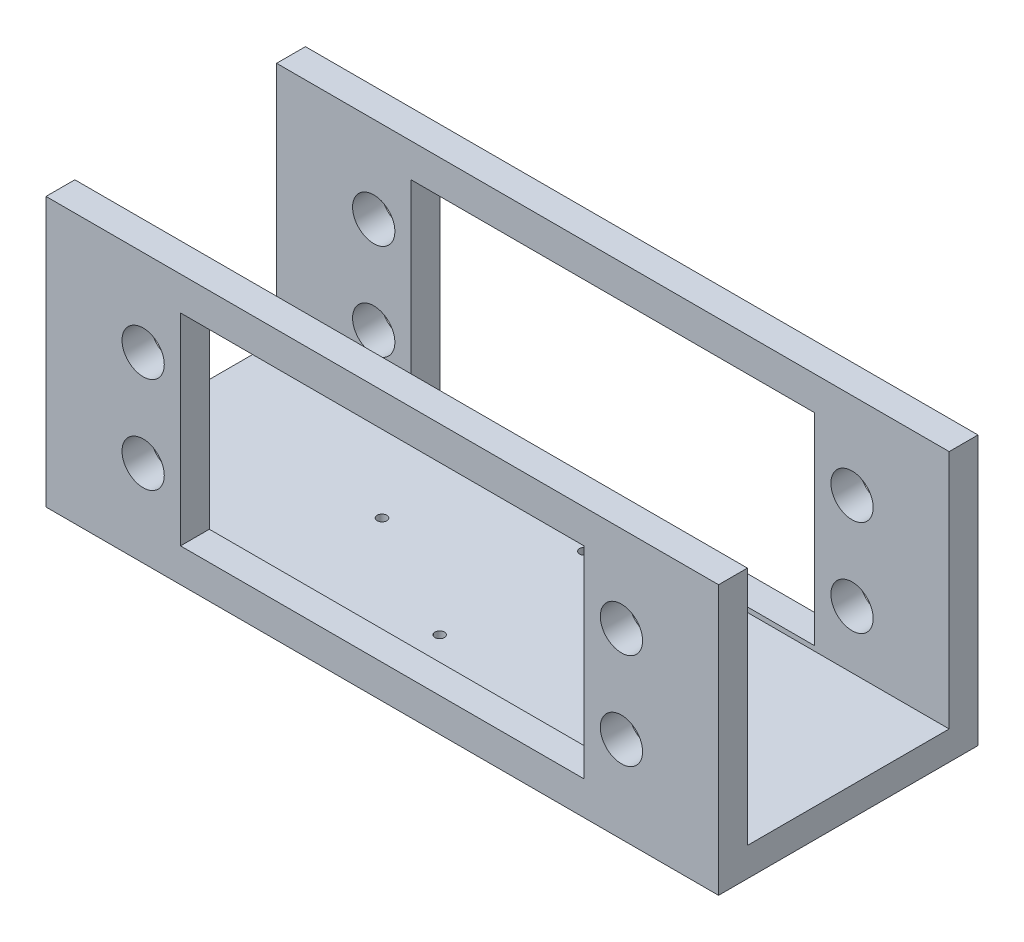
ISO-10303-21;
HEADER;
FILE_DESCRIPTION(('STEP AP214'),'2;1');
FILE_NAME('part.step','',(''),(''),'','','');
FILE_SCHEMA(('AUTOMOTIVE_DESIGN { 1 0 10303 214 1 1 1 1 }'));
ENDSEC;
DATA;
#1=APPLICATION_CONTEXT('core data for automotive mechanical design processes');
#2=APPLICATION_PROTOCOL_DEFINITION('international standard','automotive_design',2000,#1);
#3=PRODUCT_CONTEXT('',#1,'mechanical');
#4=PRODUCT('Part','Part','',(#3));
#5=PRODUCT_RELATED_PRODUCT_CATEGORY('part','',(#4));
#6=PRODUCT_DEFINITION_FORMATION('','',#4);
#7=PRODUCT_DEFINITION_CONTEXT('part definition',#1,'design');
#8=PRODUCT_DEFINITION('design','',#6,#7);
#9=PRODUCT_DEFINITION_SHAPE('','',#8);
#10=(LENGTH_UNIT() NAMED_UNIT(*) SI_UNIT(.MILLI.,.METRE.));
#11=(NAMED_UNIT(*) PLANE_ANGLE_UNIT() SI_UNIT($,.RADIAN.));
#12=(NAMED_UNIT(*) SI_UNIT($,.STERADIAN.) SOLID_ANGLE_UNIT());
#13=UNCERTAINTY_MEASURE_WITH_UNIT(LENGTH_MEASURE(1.E-05),#10,'distance_accuracy_value','');
#14=(GEOMETRIC_REPRESENTATION_CONTEXT(3) GLOBAL_UNCERTAINTY_ASSIGNED_CONTEXT((#13)) GLOBAL_UNIT_ASSIGNED_CONTEXT((#10,
#11,#12)) REPRESENTATION_CONTEXT('',''));
#15=CARTESIAN_POINT('',(0.,0.,0.));
#16=DIRECTION('',(0.,0.,1.));
#17=DIRECTION('',(1.,0.,0.));
#18=AXIS2_PLACEMENT_3D('',#15,#16,#17);
#19=CARTESIAN_POINT('',(-35.,3.,13.5));
#20=DIRECTION('',(0.,0.,-1.));
#21=DIRECTION('',(-1.,0.,0.));
#22=AXIS2_PLACEMENT_3D('',#19,#20,#21);
#23=PLANE('',#22);
#24=DIRECTION('',(0.,-1.,0.));
#25=VECTOR('',#24,1.);
#26=CARTESIAN_POINT('',(21.,24.5,13.5));
#27=LINE('',#26,#25);
#28=CARTESIAN_POINT('',(21.,24.5,13.5));
#29=VERTEX_POINT('',#28);
#30=CARTESIAN_POINT('',(21.,3.5,13.5));
#31=VERTEX_POINT('',#30);
#32=EDGE_CURVE('E255',#29,#31,#27,.T.);
#33=ORIENTED_EDGE('',*,*,#32,.T.);
#34=DIRECTION('',(1.,0.,0.));
#35=VECTOR('',#34,1.);
#36=CARTESIAN_POINT('',(-21.,3.5,13.5));
#37=LINE('',#36,#35);
#38=CARTESIAN_POINT('',(-21.,3.5,13.5));
#39=VERTEX_POINT('',#38);
#40=EDGE_CURVE('E60',#39,#31,#37,.T.);
#41=ORIENTED_EDGE('',*,*,#40,.F.);
#42=DIRECTION('',(0.,-1.,0.));
#43=VECTOR('',#42,1.);
#44=CARTESIAN_POINT('',(-21.,24.5,13.5));
#45=LINE('',#44,#43);
#46=CARTESIAN_POINT('',(-21.,24.5,13.5));
#47=VERTEX_POINT('',#46);
#48=EDGE_CURVE('E242',#47,#39,#45,.T.);
#49=ORIENTED_EDGE('',*,*,#48,.F.);
#50=DIRECTION('',(1.,0.,0.));
#51=VECTOR('',#50,1.);
#52=CARTESIAN_POINT('',(-21.,24.5,13.5));
#53=LINE('',#52,#51);
#54=EDGE_CURVE('E252',#47,#29,#53,.T.);
#55=ORIENTED_EDGE('',*,*,#54,.T.);
#56=EDGE_LOOP('',(#33,#41,#49,#55));
#57=FACE_BOUND('',#56,.T.);
#58=CARTESIAN_POINT('',(-24.89,19.,13.5));
#59=DIRECTION('',(0.,0.,1.));
#60=DIRECTION('',(1.,0.,0.));
#61=AXIS2_PLACEMENT_3D('',#58,#59,#60);
#62=CIRCLE('',#61,2.2);
#63=CARTESIAN_POINT('',(-22.69,19.,13.5));
#64=VERTEX_POINT('',#63);
#65=EDGE_CURVE('E236',#64,#64,#62,.T.);
#66=ORIENTED_EDGE('',*,*,#65,.F.);
#67=EDGE_LOOP('',(#66));
#68=FACE_BOUND('',#67,.T.);
#69=CARTESIAN_POINT('',(-24.89,9.,13.5));
#70=DIRECTION('',(0.,0.,1.));
#71=DIRECTION('',(1.,0.,0.));
#72=AXIS2_PLACEMENT_3D('',#69,#70,#71);
#73=CIRCLE('',#72,2.2);
#74=CARTESIAN_POINT('',(-22.69,9.,13.5));
#75=VERTEX_POINT('',#74);
#76=EDGE_CURVE('E239',#75,#75,#73,.F.);
#77=ORIENTED_EDGE('',*,*,#76,.T.);
#78=EDGE_LOOP('',(#77));
#79=FACE_BOUND('',#78,.T.);
#80=DIRECTION('',(0.,-1.,0.));
#81=VECTOR('',#80,1.);
#82=CARTESIAN_POINT('',(-35.,3.,13.5));
#83=LINE('',#82,#81);
#84=CARTESIAN_POINT('',(-35.,28.,13.5));
#85=VERTEX_POINT('',#84);
#86=CARTESIAN_POINT('',(-35.,0.,13.5));
#87=VERTEX_POINT('',#86);
#88=EDGE_CURVE('E324',#85,#87,#83,.T.);
#89=ORIENTED_EDGE('',*,*,#88,.T.);
#90=DIRECTION('',(1.,0.,0.));
#91=VECTOR('',#90,1.);
#92=CARTESIAN_POINT('',(-35.,0.,13.5));
#93=LINE('',#92,#91);
#94=CARTESIAN_POINT('',(35.,0.,13.5));
#95=VERTEX_POINT('',#94);
#96=EDGE_CURVE('E311',#87,#95,#93,.T.);
#97=ORIENTED_EDGE('',*,*,#96,.T.);
#98=DIRECTION('',(0.,-1.,0.));
#99=VECTOR('',#98,1.);
#100=CARTESIAN_POINT('',(35.,3.,13.5));
#101=LINE('',#100,#99);
#102=CARTESIAN_POINT('',(35.,28.,13.5));
#103=VERTEX_POINT('',#102);
#104=EDGE_CURVE('E313',#103,#95,#101,.T.);
#105=ORIENTED_EDGE('',*,*,#104,.F.);
#106=DIRECTION('',(1.,0.,0.));
#107=VECTOR('',#106,1.);
#108=CARTESIAN_POINT('',(0.,28.,13.5));
#109=LINE('',#108,#107);
#110=EDGE_CURVE('E273',#85,#103,#109,.T.);
#111=ORIENTED_EDGE('',*,*,#110,.F.);
#112=EDGE_LOOP('',(#89,#97,#105,#111));
#113=FACE_BOUND('',#112,.T.);
#114=CARTESIAN_POINT('',(24.89,19.,13.5));
#115=DIRECTION('',(0.,0.,-1.));
#116=DIRECTION('',(-1.,0.,0.));
#117=AXIS2_PLACEMENT_3D('',#114,#115,#116);
#118=CIRCLE('',#117,2.2);
#119=CARTESIAN_POINT('',(22.69,19.,13.5));
#120=VERTEX_POINT('',#119);
#121=EDGE_CURVE('E249',#120,#120,#118,.T.);
#122=ORIENTED_EDGE('',*,*,#121,.T.);
#123=EDGE_LOOP('',(#122));
#124=FACE_BOUND('',#123,.T.);
#125=CARTESIAN_POINT('',(24.89,9.00000000000001,13.5));
#126=DIRECTION('',(0.,0.,1.));
#127=DIRECTION('',(1.,0.,0.));
#128=AXIS2_PLACEMENT_3D('',#125,#126,#127);
#129=CIRCLE('',#128,2.2);
#130=CARTESIAN_POINT('',(27.09,9.00000000000001,13.5));
#131=VERTEX_POINT('',#130);
#132=EDGE_CURVE('E231',#131,#131,#129,.T.);
#133=ORIENTED_EDGE('',*,*,#132,.F.);
#134=EDGE_LOOP('',(#133));
#135=FACE_BOUND('',#134,.T.);
#136=ADVANCED_FACE('F35',(#57,#68,#79,#113,#124,#135),#23,.F.);
#137=CARTESIAN_POINT('',(0.,28.,10.5));
#138=DIRECTION('',(0.,0.,-1.));
#139=DIRECTION('',(-1.,0.,0.));
#140=AXIS2_PLACEMENT_3D('',#137,#138,#139);
#141=PLANE('',#140);
#142=CARTESIAN_POINT('',(24.89,19.,10.5));
#143=DIRECTION('',(0.,0.,-1.));
#144=DIRECTION('',(-1.,0.,0.));
#145=AXIS2_PLACEMENT_3D('',#142,#143,#144);
#146=CIRCLE('',#145,2.2);
#147=CARTESIAN_POINT('',(22.69,19.,10.5));
#148=VERTEX_POINT('',#147);
#149=EDGE_CURVE('E338',#148,#148,#146,.F.);
#150=ORIENTED_EDGE('',*,*,#149,.T.);
#151=EDGE_LOOP('',(#150));
#152=FACE_BOUND('',#151,.T.);
#153=CARTESIAN_POINT('',(-24.89,19.,10.5));
#154=DIRECTION('',(0.,0.,-1.));
#155=DIRECTION('',(-1.,0.,0.));
#156=AXIS2_PLACEMENT_3D('',#153,#154,#155);
#157=CIRCLE('',#156,2.2);
#158=CARTESIAN_POINT('',(-27.09,19.,10.5));
#159=VERTEX_POINT('',#158);
#160=EDGE_CURVE('E335',#159,#159,#157,.T.);
#161=ORIENTED_EDGE('',*,*,#160,.F.);
#162=EDGE_LOOP('',(#161));
#163=FACE_BOUND('',#162,.T.);
#164=DIRECTION('',(1.,0.,0.));
#165=VECTOR('',#164,1.);
#166=CARTESIAN_POINT('',(0.,3.,10.5));
#167=LINE('',#166,#165);
#168=CARTESIAN_POINT('',(-35.,3.,10.5));
#169=VERTEX_POINT('',#168);
#170=CARTESIAN_POINT('',(35.,3.,10.5));
#171=VERTEX_POINT('',#170);
#172=EDGE_CURVE('E270',#169,#171,#167,.T.);
#173=ORIENTED_EDGE('',*,*,#172,.F.);
#174=DIRECTION('',(0.,-1.,0.));
#175=VECTOR('',#174,1.);
#176=CARTESIAN_POINT('',(-35.,28.,10.5));
#177=LINE('',#176,#175);
#178=CARTESIAN_POINT('',(-35.,28.,10.5));
#179=VERTEX_POINT('',#178);
#180=EDGE_CURVE('E281',#179,#169,#177,.T.);
#181=ORIENTED_EDGE('',*,*,#180,.F.);
#182=DIRECTION('',(1.,0.,0.));
#183=VECTOR('',#182,1.);
#184=CARTESIAN_POINT('',(0.,28.,10.5));
#185=LINE('',#184,#183);
#186=CARTESIAN_POINT('',(35.,28.,10.5));
#187=VERTEX_POINT('',#186);
#188=EDGE_CURVE('E266',#179,#187,#185,.T.);
#189=ORIENTED_EDGE('',*,*,#188,.T.);
#190=DIRECTION('',(0.,-1.,0.));
#191=VECTOR('',#190,1.);
#192=CARTESIAN_POINT('',(35.,28.,10.5));
#193=LINE('',#192,#191);
#194=EDGE_CURVE('E278',#187,#171,#193,.T.);
#195=ORIENTED_EDGE('',*,*,#194,.T.);
#196=EDGE_LOOP('',(#173,#181,#189,#195));
#197=FACE_BOUND('',#196,.T.);
#198=CARTESIAN_POINT('',(-24.89,9.,10.5));
#199=DIRECTION('',(0.,0.,-1.));
#200=DIRECTION('',(-1.,0.,0.));
#201=AXIS2_PLACEMENT_3D('',#198,#199,#200);
#202=CIRCLE('',#201,2.2);
#203=CARTESIAN_POINT('',(-27.09,9.,10.5));
#204=VERTEX_POINT('',#203);
#205=EDGE_CURVE('E265',#204,#204,#202,.F.);
#206=ORIENTED_EDGE('',*,*,#205,.T.);
#207=EDGE_LOOP('',(#206));
#208=FACE_BOUND('',#207,.T.);
#209=DIRECTION('',(-1.,0.,0.));
#210=VECTOR('',#209,1.);
#211=CARTESIAN_POINT('',(0.,3.5,10.5));
#212=LINE('',#211,#210);
#213=CARTESIAN_POINT('',(21.,3.5,10.5));
#214=VERTEX_POINT('',#213);
#215=CARTESIAN_POINT('',(-21.,3.5,10.5));
#216=VERTEX_POINT('',#215);
#217=EDGE_CURVE('E11',#214,#216,#212,.T.);
#218=ORIENTED_EDGE('',*,*,#217,.F.);
#219=DIRECTION('',(0.,1.,0.));
#220=VECTOR('',#219,1.);
#221=CARTESIAN_POINT('',(21.,28.,10.5));
#222=LINE('',#221,#220);
#223=CARTESIAN_POINT('',(21.,24.5,10.5));
#224=VERTEX_POINT('',#223);
#225=EDGE_CURVE('E332',#214,#224,#222,.T.);
#226=ORIENTED_EDGE('',*,*,#225,.T.);
#227=DIRECTION('',(-1.,0.,0.));
#228=VECTOR('',#227,1.);
#229=CARTESIAN_POINT('',(0.,24.5,10.5));
#230=LINE('',#229,#228);
#231=CARTESIAN_POINT('',(-21.,24.5,10.5));
#232=VERTEX_POINT('',#231);
#233=EDGE_CURVE('E341',#224,#232,#230,.T.);
#234=ORIENTED_EDGE('',*,*,#233,.T.);
#235=DIRECTION('',(0.,1.,0.));
#236=VECTOR('',#235,1.);
#237=CARTESIAN_POINT('',(-21.,28.,10.5));
#238=LINE('',#237,#236);
#239=EDGE_CURVE('E44',#216,#232,#238,.T.);
#240=ORIENTED_EDGE('',*,*,#239,.F.);
#241=EDGE_LOOP('',(#218,#226,#234,#240));
#242=FACE_BOUND('',#241,.T.);
#243=CARTESIAN_POINT('',(24.89,9.00000000000001,10.5));
#244=DIRECTION('',(0.,0.,-1.));
#245=DIRECTION('',(-1.,0.,0.));
#246=AXIS2_PLACEMENT_3D('',#243,#244,#245);
#247=CIRCLE('',#246,2.2);
#248=CARTESIAN_POINT('',(22.69,9.00000000000001,10.5));
#249=VERTEX_POINT('',#248);
#250=EDGE_CURVE('E39',#249,#249,#247,.T.);
#251=ORIENTED_EDGE('',*,*,#250,.F.);
#252=EDGE_LOOP('',(#251));
#253=FACE_BOUND('',#252,.T.);
#254=ADVANCED_FACE('F353',(#152,#163,#197,#208,#242,#253),#141,.T.);
#255=CARTESIAN_POINT('',(0.,3.,0.));
#256=DIRECTION('',(0.,1.,0.));
#257=DIRECTION('',(0.,0.,1.));
#258=AXIS2_PLACEMENT_3D('',#255,#256,#257);
#259=PLANE('',#258);
#260=DIRECTION('',(1.,0.,0.));
#261=VECTOR('',#260,1.);
#262=CARTESIAN_POINT('',(0.,3.,-10.5));
#263=LINE('',#262,#261);
#264=CARTESIAN_POINT('',(-35.,3.,-10.5));
#265=VERTEX_POINT('',#264);
#266=CARTESIAN_POINT('',(35.,3.,-10.5));
#267=VERTEX_POINT('',#266);
#268=EDGE_CURVE('E200',#265,#267,#263,.T.);
#269=ORIENTED_EDGE('',*,*,#268,.F.);
#270=DIRECTION('',(0.,0.,1.));
#271=VECTOR('',#270,1.);
#272=CARTESIAN_POINT('',(-35.,3.,-13.5));
#273=LINE('',#272,#271);
#274=EDGE_CURVE('E310',#265,#169,#273,.T.);
#275=ORIENTED_EDGE('',*,*,#274,.T.);
#276=ORIENTED_EDGE('',*,*,#172,.T.);
#277=DIRECTION('',(0.,0.,-1.));
#278=VECTOR('',#277,1.);
#279=CARTESIAN_POINT('',(35.,3.,-13.5));
#280=LINE('',#279,#278);
#281=EDGE_CURVE('E52',#171,#267,#280,.T.);
#282=ORIENTED_EDGE('',*,*,#281,.T.);
#283=EDGE_LOOP('',(#269,#275,#276,#282));
#284=FACE_BOUND('',#283,.T.);
#285=CARTESIAN_POINT('',(0.,3.,7.53));
#286=DIRECTION('',(0.,1.,0.));
#287=DIRECTION('',(0.,0.,-1.));
#288=AXIS2_PLACEMENT_3D('',#285,#286,#287);
#289=CIRCLE('',#288,0.5);
#290=CARTESIAN_POINT('',(0.,3.,7.03));
#291=VERTEX_POINT('',#290);
#292=EDGE_CURVE('E291',#291,#291,#289,.T.);
#293=ORIENTED_EDGE('',*,*,#292,.F.);
#294=EDGE_LOOP('',(#293));
#295=FACE_BOUND('',#294,.T.);
#296=CARTESIAN_POINT('',(-13.53,3.,0.));
#297=DIRECTION('',(0.,1.,0.));
#298=DIRECTION('',(0.,0.,1.));
#299=AXIS2_PLACEMENT_3D('',#296,#297,#298);
#300=CIRCLE('',#299,0.500000000000001);
#301=CARTESIAN_POINT('',(-13.53,3.,0.500000000000001));
#302=VERTEX_POINT('',#301);
#303=EDGE_CURVE('E303',#302,#302,#300,.T.);
#304=ORIENTED_EDGE('',*,*,#303,.F.);
#305=EDGE_LOOP('',(#304));
#306=FACE_BOUND('',#305,.T.);
#307=CARTESIAN_POINT('',(0.,3.,-7.53));
#308=DIRECTION('',(0.,1.,0.));
#309=DIRECTION('',(0.,0.,1.));
#310=AXIS2_PLACEMENT_3D('',#307,#308,#309);
#311=CIRCLE('',#310,0.5);
#312=CARTESIAN_POINT('',(0.,3.,-7.03));
#313=VERTEX_POINT('',#312);
#314=EDGE_CURVE('E297',#313,#313,#311,.T.);
#315=ORIENTED_EDGE('',*,*,#314,.F.);
#316=EDGE_LOOP('',(#315));
#317=FACE_BOUND('',#316,.T.);
#318=CARTESIAN_POINT('',(13.53,3.,0.));
#319=DIRECTION('',(0.,1.,0.));
#320=DIRECTION('',(0.,0.,-1.));
#321=AXIS2_PLACEMENT_3D('',#318,#319,#320);
#322=CIRCLE('',#321,0.500000000000001);
#323=CARTESIAN_POINT('',(13.53,3.,-0.500000000000004));
#324=VERTEX_POINT('',#323);
#325=EDGE_CURVE('E285',#324,#324,#322,.T.);
#326=ORIENTED_EDGE('',*,*,#325,.F.);
#327=EDGE_LOOP('',(#326));
#328=FACE_BOUND('',#327,.T.);
#329=ADVANCED_FACE('F355',(#284,#295,#306,#317,#328),#259,.T.);
#330=CARTESIAN_POINT('',(0.,0.,0.));
#331=DIRECTION('',(0.,1.,0.));
#332=DIRECTION('',(0.,0.,1.));
#333=AXIS2_PLACEMENT_3D('',#330,#331,#332);
#334=PLANE('',#333);
#335=DIRECTION('',(0.,0.,-1.));
#336=VECTOR('',#335,1.);
#337=CARTESIAN_POINT('',(35.,0.,-13.5));
#338=LINE('',#337,#336);
#339=CARTESIAN_POINT('',(35.,0.,-13.5));
#340=VERTEX_POINT('',#339);
#341=EDGE_CURVE('E306',#95,#340,#338,.T.);
#342=ORIENTED_EDGE('',*,*,#341,.F.);
#343=ORIENTED_EDGE('',*,*,#96,.F.);
#344=DIRECTION('',(0.,0.,1.));
#345=VECTOR('',#344,1.);
#346=CARTESIAN_POINT('',(-35.,0.,-13.5));
#347=LINE('',#346,#345);
#348=CARTESIAN_POINT('',(-35.,0.,-13.5));
#349=VERTEX_POINT('',#348);
#350=EDGE_CURVE('E318',#349,#87,#347,.T.);
#351=ORIENTED_EDGE('',*,*,#350,.F.);
#352=DIRECTION('',(-1.,0.,0.));
#353=VECTOR('',#352,1.);
#354=CARTESIAN_POINT('',(-35.,0.,-13.5));
#355=LINE('',#354,#353);
#356=EDGE_CURVE('E316',#340,#349,#355,.T.);
#357=ORIENTED_EDGE('',*,*,#356,.F.);
#358=EDGE_LOOP('',(#342,#343,#351,#357));
#359=FACE_BOUND('',#358,.T.);
#360=CARTESIAN_POINT('',(-13.53,0.,0.));
#361=DIRECTION('',(0.,1.,0.));
#362=DIRECTION('',(0.,0.,1.));
#363=AXIS2_PLACEMENT_3D('',#360,#361,#362);
#364=CIRCLE('',#363,0.500000000000001);
#365=CARTESIAN_POINT('',(-13.53,0.,0.500000000000001));
#366=VERTEX_POINT('',#365);
#367=EDGE_CURVE('E300',#366,#366,#364,.T.);
#368=ORIENTED_EDGE('',*,*,#367,.T.);
#369=EDGE_LOOP('',(#368));
#370=FACE_BOUND('',#369,.T.);
#371=CARTESIAN_POINT('',(0.,0.,-7.53));
#372=DIRECTION('',(0.,1.,0.));
#373=DIRECTION('',(0.,0.,1.));
#374=AXIS2_PLACEMENT_3D('',#371,#372,#373);
#375=CIRCLE('',#374,0.5);
#376=CARTESIAN_POINT('',(0.,0.,-7.03));
#377=VERTEX_POINT('',#376);
#378=EDGE_CURVE('E294',#377,#377,#375,.T.);
#379=ORIENTED_EDGE('',*,*,#378,.T.);
#380=EDGE_LOOP('',(#379));
#381=FACE_BOUND('',#380,.T.);
#382=CARTESIAN_POINT('',(0.,0.,7.53));
#383=DIRECTION('',(0.,1.,0.));
#384=DIRECTION('',(0.,0.,-1.));
#385=AXIS2_PLACEMENT_3D('',#382,#383,#384);
#386=CIRCLE('',#385,0.5);
#387=CARTESIAN_POINT('',(0.,0.,7.03));
#388=VERTEX_POINT('',#387);
#389=EDGE_CURVE('E288',#388,#388,#386,.T.);
#390=ORIENTED_EDGE('',*,*,#389,.T.);
#391=EDGE_LOOP('',(#390));
#392=FACE_BOUND('',#391,.T.);
#393=CARTESIAN_POINT('',(13.53,0.,0.));
#394=DIRECTION('',(0.,1.,0.));
#395=DIRECTION('',(0.,0.,-1.));
#396=AXIS2_PLACEMENT_3D('',#393,#394,#395);
#397=CIRCLE('',#396,0.500000000000001);
#398=CARTESIAN_POINT('',(13.53,0.,-0.500000000000004));
#399=VERTEX_POINT('',#398);
#400=EDGE_CURVE('E284',#399,#399,#397,.T.);
#401=ORIENTED_EDGE('',*,*,#400,.T.);
#402=EDGE_LOOP('',(#401));
#403=FACE_BOUND('',#402,.T.);
#404=ADVANCED_FACE('F361',(#359,#370,#381,#392,#403),#334,.F.);
#405=CARTESIAN_POINT('',(35.,3.,-13.5));
#406=DIRECTION('',(-1.,0.,0.));
#407=DIRECTION('',(0.,0.,1.));
#408=AXIS2_PLACEMENT_3D('',#405,#406,#407);
#409=PLANE('',#408);
#410=ORIENTED_EDGE('',*,*,#104,.T.);
#411=ORIENTED_EDGE('',*,*,#341,.T.);
#412=DIRECTION('',(0.,-1.,0.));
#413=VECTOR('',#412,1.);
#414=CARTESIAN_POINT('',(35.,3.,-13.5));
#415=LINE('',#414,#413);
#416=CARTESIAN_POINT('',(35.,28.,-13.5));
#417=VERTEX_POINT('',#416);
#418=EDGE_CURVE('E329',#417,#340,#415,.T.);
#419=ORIENTED_EDGE('',*,*,#418,.F.);
#420=DIRECTION('',(0.,0.,1.));
#421=VECTOR('',#420,1.);
#422=CARTESIAN_POINT('',(35.,28.,0.));
#423=LINE('',#422,#421);
#424=CARTESIAN_POINT('',(35.,28.,-10.5));
#425=VERTEX_POINT('',#424);
#426=EDGE_CURVE('E206',#417,#425,#423,.T.);
#427=ORIENTED_EDGE('',*,*,#426,.T.);
#428=DIRECTION('',(0.,-1.,0.));
#429=VECTOR('',#428,1.);
#430=CARTESIAN_POINT('',(35.,28.,-10.5));
#431=LINE('',#430,#429);
#432=EDGE_CURVE('E208',#425,#267,#431,.T.);
#433=ORIENTED_EDGE('',*,*,#432,.T.);
#434=ORIENTED_EDGE('',*,*,#281,.F.);
#435=ORIENTED_EDGE('',*,*,#194,.F.);
#436=DIRECTION('',(0.,0.,-1.));
#437=VECTOR('',#436,1.);
#438=CARTESIAN_POINT('',(35.,28.,0.));
#439=LINE('',#438,#437);
#440=EDGE_CURVE('E276',#103,#187,#439,.T.);
#441=ORIENTED_EDGE('',*,*,#440,.F.);
#442=EDGE_LOOP('',(#410,#411,#419,#427,#433,#434,#435,#441));
#443=FACE_BOUND('',#442,.T.);
#444=ADVANCED_FACE('F37',(#443),#409,.F.);
#445=CARTESIAN_POINT('',(-35.,3.,-13.5));
#446=DIRECTION('',(0.,0.,1.));
#447=DIRECTION('',(1.,0.,0.));
#448=AXIS2_PLACEMENT_3D('',#445,#446,#447);
#449=PLANE('',#448);
#450=ORIENTED_EDGE('',*,*,#356,.T.);
#451=DIRECTION('',(0.,-1.,0.));
#452=VECTOR('',#451,1.);
#453=CARTESIAN_POINT('',(-35.,3.,-13.5));
#454=LINE('',#453,#452);
#455=CARTESIAN_POINT('',(-35.,28.,-13.5));
#456=VERTEX_POINT('',#455);
#457=EDGE_CURVE('E326',#456,#349,#454,.T.);
#458=ORIENTED_EDGE('',*,*,#457,.F.);
#459=DIRECTION('',(1.,0.,0.));
#460=VECTOR('',#459,1.);
#461=CARTESIAN_POINT('',(0.,28.,-13.5));
#462=LINE('',#461,#460);
#463=EDGE_CURVE('E203',#456,#417,#462,.T.);
#464=ORIENTED_EDGE('',*,*,#463,.T.);
#465=ORIENTED_EDGE('',*,*,#418,.T.);
#466=EDGE_LOOP('',(#450,#458,#464,#465));
#467=FACE_BOUND('',#466,.T.);
#468=DIRECTION('',(0.,-1.,0.));
#469=VECTOR('',#468,1.);
#470=CARTESIAN_POINT('',(21.,24.5,-13.5));
#471=LINE('',#470,#469);
#472=CARTESIAN_POINT('',(21.,24.5,-13.5));
#473=VERTEX_POINT('',#472);
#474=CARTESIAN_POINT('',(21.,3.5,-13.5));
#475=VERTEX_POINT('',#474);
#476=EDGE_CURVE('E174',#473,#475,#471,.T.);
#477=ORIENTED_EDGE('',*,*,#476,.F.);
#478=DIRECTION('',(1.,0.,0.));
#479=VECTOR('',#478,1.);
#480=CARTESIAN_POINT('',(-21.,24.5,-13.5));
#481=LINE('',#480,#479);
#482=CARTESIAN_POINT('',(-21.,24.5,-13.5));
#483=VERTEX_POINT('',#482);
#484=EDGE_CURVE('E179',#483,#473,#481,.T.);
#485=ORIENTED_EDGE('',*,*,#484,.F.);
#486=DIRECTION('',(0.,-1.,0.));
#487=VECTOR('',#486,1.);
#488=CARTESIAN_POINT('',(-21.,24.5,-13.5));
#489=LINE('',#488,#487);
#490=CARTESIAN_POINT('',(-21.,3.5,-13.5));
#491=VERTEX_POINT('',#490);
#492=EDGE_CURVE('E156',#483,#491,#489,.T.);
#493=ORIENTED_EDGE('',*,*,#492,.T.);
#494=DIRECTION('',(1.,0.,0.));
#495=VECTOR('',#494,1.);
#496=CARTESIAN_POINT('',(-21.,3.5,-13.5));
#497=LINE('',#496,#495);
#498=EDGE_CURVE('E167',#491,#475,#497,.T.);
#499=ORIENTED_EDGE('',*,*,#498,.T.);
#500=EDGE_LOOP('',(#477,#485,#493,#499));
#501=FACE_BOUND('',#500,.T.);
#502=CARTESIAN_POINT('',(-24.89,19.,-13.5));
#503=DIRECTION('',(0.,0.,1.));
#504=DIRECTION('',(1.,0.,0.));
#505=AXIS2_PLACEMENT_3D('',#502,#503,#504);
#506=CIRCLE('',#505,2.2);
#507=CARTESIAN_POINT('',(-22.69,19.,-13.5));
#508=VERTEX_POINT('',#507);
#509=EDGE_CURVE('E173',#508,#508,#506,.T.);
#510=ORIENTED_EDGE('',*,*,#509,.T.);
#511=EDGE_LOOP('',(#510));
#512=FACE_BOUND('',#511,.T.);
#513=CARTESIAN_POINT('',(-24.89,9.,-13.5));
#514=DIRECTION('',(0.,0.,1.));
#515=DIRECTION('',(1.,0.,0.));
#516=AXIS2_PLACEMENT_3D('',#513,#514,#515);
#517=CIRCLE('',#516,2.2);
#518=CARTESIAN_POINT('',(-22.69,9.,-13.5));
#519=VERTEX_POINT('',#518);
#520=EDGE_CURVE('E192',#519,#519,#517,.F.);
#521=ORIENTED_EDGE('',*,*,#520,.F.);
#522=EDGE_LOOP('',(#521));
#523=FACE_BOUND('',#522,.T.);
#524=CARTESIAN_POINT('',(24.89,19.,-13.5));
#525=DIRECTION('',(0.,0.,-1.));
#526=DIRECTION('',(-1.,0.,0.));
#527=AXIS2_PLACEMENT_3D('',#524,#525,#526);
#528=CIRCLE('',#527,2.2);
#529=CARTESIAN_POINT('',(22.69,19.,-13.5));
#530=VERTEX_POINT('',#529);
#531=EDGE_CURVE('E164',#530,#530,#528,.T.);
#532=ORIENTED_EDGE('',*,*,#531,.F.);
#533=EDGE_LOOP('',(#532));
#534=FACE_BOUND('',#533,.T.);
#535=CARTESIAN_POINT('',(24.89,9.00000000000001,-13.5));
#536=DIRECTION('',(0.,0.,1.));
#537=DIRECTION('',(1.,0.,0.));
#538=AXIS2_PLACEMENT_3D('',#535,#536,#537);
#539=CIRCLE('',#538,2.2);
#540=CARTESIAN_POINT('',(27.09,9.00000000000001,-13.5));
#541=VERTEX_POINT('',#540);
#542=EDGE_CURVE('E189',#541,#541,#539,.T.);
#543=ORIENTED_EDGE('',*,*,#542,.T.);
#544=EDGE_LOOP('',(#543));
#545=FACE_BOUND('',#544,.T.);
#546=ADVANCED_FACE('F176',(#467,#501,#512,#523,#534,#545),#449,.F.);
#547=CARTESIAN_POINT('',(-35.,3.,-13.5));
#548=DIRECTION('',(1.,0.,0.));
#549=DIRECTION('',(0.,0.,-1.));
#550=AXIS2_PLACEMENT_3D('',#547,#548,#549);
#551=PLANE('',#550);
#552=ORIENTED_EDGE('',*,*,#180,.T.);
#553=ORIENTED_EDGE('',*,*,#274,.F.);
#554=DIRECTION('',(0.,-1.,0.));
#555=VECTOR('',#554,1.);
#556=CARTESIAN_POINT('',(-35.,28.,-10.5));
#557=LINE('',#556,#555);
#558=CARTESIAN_POINT('',(-35.,28.,-10.5));
#559=VERTEX_POINT('',#558);
#560=EDGE_CURVE('E213',#559,#265,#557,.T.);
#561=ORIENTED_EDGE('',*,*,#560,.F.);
#562=DIRECTION('',(0.,0.,-1.));
#563=VECTOR('',#562,1.);
#564=CARTESIAN_POINT('',(-35.,28.,0.));
#565=LINE('',#564,#563);
#566=EDGE_CURVE('E199',#559,#456,#565,.T.);
#567=ORIENTED_EDGE('',*,*,#566,.T.);
#568=ORIENTED_EDGE('',*,*,#457,.T.);
#569=ORIENTED_EDGE('',*,*,#350,.T.);
#570=ORIENTED_EDGE('',*,*,#88,.F.);
#571=DIRECTION('',(0.,0.,1.));
#572=VECTOR('',#571,1.);
#573=CARTESIAN_POINT('',(-35.,28.,0.));
#574=LINE('',#573,#572);
#575=EDGE_CURVE('E269',#179,#85,#574,.T.);
#576=ORIENTED_EDGE('',*,*,#575,.F.);
#577=EDGE_LOOP('',(#552,#553,#561,#567,#568,#569,#570,#576));
#578=FACE_BOUND('',#577,.T.);
#579=ADVANCED_FACE('F384',(#578),#551,.F.);
#580=CARTESIAN_POINT('',(-13.53,3.,0.));
#581=DIRECTION('',(0.,-1.,0.));
#582=DIRECTION('',(0.,0.,-1.));
#583=AXIS2_PLACEMENT_3D('',#580,#581,#582);
#584=CYLINDRICAL_SURFACE('',#583,0.500000000000001);
#585=ORIENTED_EDGE('',*,*,#303,.T.);
#586=EDGE_LOOP('',(#585));
#587=FACE_BOUND('',#586,.T.);
#588=ORIENTED_EDGE('',*,*,#367,.F.);
#589=EDGE_LOOP('',(#588));
#590=FACE_BOUND('',#589,.T.);
#591=ADVANCED_FACE('F381',(#587,#590),#584,.F.);
#592=CARTESIAN_POINT('',(0.,3.,-7.53));
#593=DIRECTION('',(0.,-1.,0.));
#594=DIRECTION('',(0.,0.,-1.));
#595=AXIS2_PLACEMENT_3D('',#592,#593,#594);
#596=CYLINDRICAL_SURFACE('',#595,0.5);
#597=ORIENTED_EDGE('',*,*,#314,.T.);
#598=EDGE_LOOP('',(#597));
#599=FACE_BOUND('',#598,.T.);
#600=ORIENTED_EDGE('',*,*,#378,.F.);
#601=EDGE_LOOP('',(#600));
#602=FACE_BOUND('',#601,.T.);
#603=ADVANCED_FACE('F377',(#599,#602),#596,.F.);
#604=CARTESIAN_POINT('',(0.,3.,7.53));
#605=DIRECTION('',(0.,-1.,0.));
#606=DIRECTION('',(0.,0.,-1.));
#607=AXIS2_PLACEMENT_3D('',#604,#605,#606);
#608=CYLINDRICAL_SURFACE('',#607,0.5);
#609=ORIENTED_EDGE('',*,*,#292,.T.);
#610=EDGE_LOOP('',(#609));
#611=FACE_BOUND('',#610,.T.);
#612=ORIENTED_EDGE('',*,*,#389,.F.);
#613=EDGE_LOOP('',(#612));
#614=FACE_BOUND('',#613,.T.);
#615=ADVANCED_FACE('F373',(#611,#614),#608,.F.);
#616=CARTESIAN_POINT('',(13.53,3.,0.));
#617=DIRECTION('',(0.,-1.,0.));
#618=DIRECTION('',(0.,0.,-1.));
#619=AXIS2_PLACEMENT_3D('',#616,#617,#618);
#620=CYLINDRICAL_SURFACE('',#619,0.500000000000001);
#621=ORIENTED_EDGE('',*,*,#325,.T.);
#622=EDGE_LOOP('',(#621));
#623=FACE_BOUND('',#622,.T.);
#624=ORIENTED_EDGE('',*,*,#400,.F.);
#625=EDGE_LOOP('',(#624));
#626=FACE_BOUND('',#625,.T.);
#627=ADVANCED_FACE('F370',(#623,#626),#620,.F.);
#628=CARTESIAN_POINT('',(0.,28.,0.));
#629=DIRECTION('',(0.,1.,0.));
#630=DIRECTION('',(0.,0.,1.));
#631=AXIS2_PLACEMENT_3D('',#628,#629,#630);
#632=PLANE('',#631);
#633=ORIENTED_EDGE('',*,*,#188,.F.);
#634=ORIENTED_EDGE('',*,*,#575,.T.);
#635=ORIENTED_EDGE('',*,*,#110,.T.);
#636=ORIENTED_EDGE('',*,*,#440,.T.);
#637=EDGE_LOOP('',(#633,#634,#635,#636));
#638=FACE_BOUND('',#637,.T.);
#639=ADVANCED_FACE('F368',(#638),#632,.T.);
#640=CARTESIAN_POINT('',(-24.89,9.,-11.5));
#641=DIRECTION('',(0.,0.,1.));
#642=DIRECTION('',(1.,0.,0.));
#643=AXIS2_PLACEMENT_3D('',#640,#641,#642);
#644=CYLINDRICAL_SURFACE('',#643,2.2);
#645=ORIENTED_EDGE('',*,*,#205,.F.);
#646=EDGE_LOOP('',(#645));
#647=FACE_BOUND('',#646,.T.);
#648=ORIENTED_EDGE('',*,*,#76,.F.);
#649=EDGE_LOOP('',(#648));
#650=FACE_BOUND('',#649,.T.);
#651=ADVANCED_FACE('F442',(#647,#650),#644,.F.);
#652=CARTESIAN_POINT('',(-24.89,19.,-11.5));
#653=DIRECTION('',(0.,0.,1.));
#654=DIRECTION('',(1.,0.,0.));
#655=AXIS2_PLACEMENT_3D('',#652,#653,#654);
#656=CYLINDRICAL_SURFACE('',#655,2.2);
#657=ORIENTED_EDGE('',*,*,#160,.T.);
#658=EDGE_LOOP('',(#657));
#659=FACE_BOUND('',#658,.T.);
#660=ORIENTED_EDGE('',*,*,#65,.T.);
#661=EDGE_LOOP('',(#660));
#662=FACE_BOUND('',#661,.T.);
#663=ADVANCED_FACE('F438',(#659,#662),#656,.F.);
#664=CARTESIAN_POINT('',(-21.,3.5,-11.5));
#665=DIRECTION('',(0.,-1.,0.));
#666=DIRECTION('',(1.,0.,0.));
#667=AXIS2_PLACEMENT_3D('',#664,#665,#666);
#668=PLANE('',#667);
#669=ORIENTED_EDGE('',*,*,#217,.T.);
#670=DIRECTION('',(0.,0.,1.));
#671=VECTOR('',#670,1.);
#672=CARTESIAN_POINT('',(-21.,3.5,-11.5));
#673=LINE('',#672,#671);
#674=EDGE_CURVE('E247',#216,#39,#673,.T.);
#675=ORIENTED_EDGE('',*,*,#674,.T.);
#676=ORIENTED_EDGE('',*,*,#40,.T.);
#677=DIRECTION('',(0.,0.,1.));
#678=VECTOR('',#677,1.);
#679=CARTESIAN_POINT('',(21.,3.5,-11.5));
#680=LINE('',#679,#678);
#681=EDGE_CURVE('E240',#214,#31,#680,.T.);
#682=ORIENTED_EDGE('',*,*,#681,.F.);
#683=EDGE_LOOP('',(#669,#675,#676,#682));
#684=FACE_BOUND('',#683,.T.);
#685=ADVANCED_FACE('F441',(#684),#668,.F.);
#686=CARTESIAN_POINT('',(-21.,24.5,-11.5));
#687=DIRECTION('',(-1.,0.,0.));
#688=DIRECTION('',(0.,-1.,0.));
#689=AXIS2_PLACEMENT_3D('',#686,#687,#688);
#690=PLANE('',#689);
#691=ORIENTED_EDGE('',*,*,#239,.T.);
#692=DIRECTION('',(0.,0.,1.));
#693=VECTOR('',#692,1.);
#694=CARTESIAN_POINT('',(-21.,24.5,-11.5));
#695=LINE('',#694,#693);
#696=EDGE_CURVE('E245',#232,#47,#695,.T.);
#697=ORIENTED_EDGE('',*,*,#696,.T.);
#698=ORIENTED_EDGE('',*,*,#48,.T.);
#699=ORIENTED_EDGE('',*,*,#674,.F.);
#700=EDGE_LOOP('',(#691,#697,#698,#699));
#701=FACE_BOUND('',#700,.T.);
#702=ADVANCED_FACE('F446',(#701),#690,.F.);
#703=CARTESIAN_POINT('',(-21.,24.5,-11.5));
#704=DIRECTION('',(0.,-1.,0.));
#705=DIRECTION('',(0.,0.,-1.));
#706=AXIS2_PLACEMENT_3D('',#703,#704,#705);
#707=PLANE('',#706);
#708=DIRECTION('',(0.,0.,1.));
#709=VECTOR('',#708,1.);
#710=CARTESIAN_POINT('',(21.,24.5,-11.5));
#711=LINE('',#710,#709);
#712=EDGE_CURVE('E243',#224,#29,#711,.T.);
#713=ORIENTED_EDGE('',*,*,#712,.T.);
#714=ORIENTED_EDGE('',*,*,#54,.F.);
#715=ORIENTED_EDGE('',*,*,#696,.F.);
#716=ORIENTED_EDGE('',*,*,#233,.F.);
#717=EDGE_LOOP('',(#713,#714,#715,#716));
#718=FACE_BOUND('',#717,.T.);
#719=ADVANCED_FACE('F451',(#718),#707,.T.);
#720=CARTESIAN_POINT('',(21.,24.5,-11.5));
#721=DIRECTION('',(-1.,0.,0.));
#722=DIRECTION('',(0.,-1.,0.));
#723=AXIS2_PLACEMENT_3D('',#720,#721,#722);
#724=PLANE('',#723);
#725=ORIENTED_EDGE('',*,*,#681,.T.);
#726=ORIENTED_EDGE('',*,*,#32,.F.);
#727=ORIENTED_EDGE('',*,*,#712,.F.);
#728=ORIENTED_EDGE('',*,*,#225,.F.);
#729=EDGE_LOOP('',(#725,#726,#727,#728));
#730=FACE_BOUND('',#729,.T.);
#731=ADVANCED_FACE('F447',(#730),#724,.T.);
#732=CARTESIAN_POINT('',(24.89,19.,-11.5));
#733=DIRECTION('',(0.,0.,1.));
#734=DIRECTION('',(1.,0.,0.));
#735=AXIS2_PLACEMENT_3D('',#732,#733,#734);
#736=CYLINDRICAL_SURFACE('',#735,2.2);
#737=ORIENTED_EDGE('',*,*,#149,.F.);
#738=EDGE_LOOP('',(#737));
#739=FACE_BOUND('',#738,.T.);
#740=ORIENTED_EDGE('',*,*,#121,.F.);
#741=EDGE_LOOP('',(#740));
#742=FACE_BOUND('',#741,.T.);
#743=ADVANCED_FACE('F450',(#739,#742),#736,.F.);
#744=CARTESIAN_POINT('',(24.89,9.00000000000001,-11.5));
#745=DIRECTION('',(0.,0.,1.));
#746=DIRECTION('',(1.,0.,0.));
#747=AXIS2_PLACEMENT_3D('',#744,#745,#746);
#748=CYLINDRICAL_SURFACE('',#747,2.2);
#749=ORIENTED_EDGE('',*,*,#250,.T.);
#750=EDGE_LOOP('',(#749));
#751=FACE_BOUND('',#750,.T.);
#752=ORIENTED_EDGE('',*,*,#132,.T.);
#753=EDGE_LOOP('',(#752));
#754=FACE_BOUND('',#753,.T.);
#755=ADVANCED_FACE('F350',(#751,#754),#748,.F.);
#756=CARTESIAN_POINT('',(0.,28.,-10.5));
#757=DIRECTION('',(0.,0.,1.));
#758=DIRECTION('',(-1.,0.,0.));
#759=AXIS2_PLACEMENT_3D('',#756,#757,#758);
#760=PLANE('',#759);
#761=CARTESIAN_POINT('',(24.89,19.,-10.5));
#762=DIRECTION('',(0.,0.,-1.));
#763=DIRECTION('',(-1.,0.,0.));
#764=AXIS2_PLACEMENT_3D('',#761,#762,#763);
#765=CIRCLE('',#764,2.2);
#766=CARTESIAN_POINT('',(22.69,19.,-10.5));
#767=VERTEX_POINT('',#766);
#768=EDGE_CURVE('E222',#767,#767,#765,.F.);
#769=ORIENTED_EDGE('',*,*,#768,.F.);
#770=EDGE_LOOP('',(#769));
#771=FACE_BOUND('',#770,.T.);
#772=CARTESIAN_POINT('',(-24.89,19.,-10.5));
#773=DIRECTION('',(0.,0.,-1.));
#774=DIRECTION('',(-1.,0.,0.));
#775=AXIS2_PLACEMENT_3D('',#772,#773,#774);
#776=CIRCLE('',#775,2.2);
#777=CARTESIAN_POINT('',(-27.09,19.,-10.5));
#778=VERTEX_POINT('',#777);
#779=EDGE_CURVE('E219',#778,#778,#776,.T.);
#780=ORIENTED_EDGE('',*,*,#779,.T.);
#781=EDGE_LOOP('',(#780));
#782=FACE_BOUND('',#781,.T.);
#783=ORIENTED_EDGE('',*,*,#268,.T.);
#784=ORIENTED_EDGE('',*,*,#432,.F.);
#785=DIRECTION('',(1.,0.,0.));
#786=VECTOR('',#785,1.);
#787=CARTESIAN_POINT('',(0.,28.,-10.5));
#788=LINE('',#787,#786);
#789=EDGE_CURVE('E196',#559,#425,#788,.T.);
#790=ORIENTED_EDGE('',*,*,#789,.F.);
#791=ORIENTED_EDGE('',*,*,#560,.T.);
#792=EDGE_LOOP('',(#783,#784,#790,#791));
#793=FACE_BOUND('',#792,.T.);
#794=CARTESIAN_POINT('',(-24.89,9.,-10.5));
#795=DIRECTION('',(0.,0.,-1.));
#796=DIRECTION('',(-1.,0.,0.));
#797=AXIS2_PLACEMENT_3D('',#794,#795,#796);
#798=CIRCLE('',#797,2.2);
#799=CARTESIAN_POINT('',(-27.09,9.,-10.5));
#800=VERTEX_POINT('',#799);
#801=EDGE_CURVE('E195',#800,#800,#798,.F.);
#802=ORIENTED_EDGE('',*,*,#801,.F.);
#803=EDGE_LOOP('',(#802));
#804=FACE_BOUND('',#803,.T.);
#805=DIRECTION('',(-1.,0.,0.));
#806=VECTOR('',#805,1.);
#807=CARTESIAN_POINT('',(0.,3.5,-10.5));
#808=LINE('',#807,#806);
#809=CARTESIAN_POINT('',(21.,3.5,-10.5));
#810=VERTEX_POINT('',#809);
#811=CARTESIAN_POINT('',(-21.,3.5,-10.5));
#812=VERTEX_POINT('',#811);
#813=EDGE_CURVE('E229',#810,#812,#808,.T.);
#814=ORIENTED_EDGE('',*,*,#813,.T.);
#815=DIRECTION('',(0.,1.,0.));
#816=VECTOR('',#815,1.);
#817=CARTESIAN_POINT('',(-21.,28.,-10.5));
#818=LINE('',#817,#816);
#819=CARTESIAN_POINT('',(-21.,24.5,-10.5));
#820=VERTEX_POINT('',#819);
#821=EDGE_CURVE('E159',#812,#820,#818,.T.);
#822=ORIENTED_EDGE('',*,*,#821,.T.);
#823=DIRECTION('',(-1.,0.,0.));
#824=VECTOR('',#823,1.);
#825=CARTESIAN_POINT('',(0.,24.5,-10.5));
#826=LINE('',#825,#824);
#827=CARTESIAN_POINT('',(21.,24.5,-10.5));
#828=VERTEX_POINT('',#827);
#829=EDGE_CURVE('E225',#828,#820,#826,.T.);
#830=ORIENTED_EDGE('',*,*,#829,.F.);
#831=DIRECTION('',(0.,1.,0.));
#832=VECTOR('',#831,1.);
#833=CARTESIAN_POINT('',(21.,28.,-10.5));
#834=LINE('',#833,#832);
#835=EDGE_CURVE('E216',#810,#828,#834,.T.);
#836=ORIENTED_EDGE('',*,*,#835,.F.);
#837=EDGE_LOOP('',(#814,#822,#830,#836));
#838=FACE_BOUND('',#837,.T.);
#839=CARTESIAN_POINT('',(24.89,9.00000000000001,-10.5));
#840=DIRECTION('',(0.,0.,-1.));
#841=DIRECTION('',(-1.,0.,0.));
#842=AXIS2_PLACEMENT_3D('',#839,#840,#841);
#843=CIRCLE('',#842,2.2);
#844=CARTESIAN_POINT('',(22.69,9.00000000000001,-10.5));
#845=VERTEX_POINT('',#844);
#846=EDGE_CURVE('E211',#845,#845,#843,.T.);
#847=ORIENTED_EDGE('',*,*,#846,.T.);
#848=EDGE_LOOP('',(#847));
#849=FACE_BOUND('',#848,.T.);
#850=ADVANCED_FACE('F419',(#771,#782,#793,#804,#838,#849),#760,.T.);
#851=CARTESIAN_POINT('',(0.,28.,0.));
#852=DIRECTION('',(0.,1.,0.));
#853=DIRECTION('',(0.,0.,-1.));
#854=AXIS2_PLACEMENT_3D('',#851,#852,#853);
#855=PLANE('',#854);
#856=ORIENTED_EDGE('',*,*,#789,.T.);
#857=ORIENTED_EDGE('',*,*,#426,.F.);
#858=ORIENTED_EDGE('',*,*,#463,.F.);
#859=ORIENTED_EDGE('',*,*,#566,.F.);
#860=EDGE_LOOP('',(#856,#857,#858,#859));
#861=FACE_BOUND('',#860,.T.);
#862=ADVANCED_FACE('F423',(#861),#855,.T.);
#863=CARTESIAN_POINT('',(-24.89,9.,11.5));
#864=DIRECTION('',(0.,0.,-1.));
#865=DIRECTION('',(1.,0.,0.));
#866=AXIS2_PLACEMENT_3D('',#863,#864,#865);
#867=CYLINDRICAL_SURFACE('',#866,2.2);
#868=ORIENTED_EDGE('',*,*,#801,.T.);
#869=EDGE_LOOP('',(#868));
#870=FACE_BOUND('',#869,.T.);
#871=ORIENTED_EDGE('',*,*,#520,.T.);
#872=EDGE_LOOP('',(#871));
#873=FACE_BOUND('',#872,.T.);
#874=ADVANCED_FACE('F425',(#870,#873),#867,.F.);
#875=CARTESIAN_POINT('',(-24.89,19.,11.5));
#876=DIRECTION('',(0.,0.,-1.));
#877=DIRECTION('',(1.,0.,0.));
#878=AXIS2_PLACEMENT_3D('',#875,#876,#877);
#879=CYLINDRICAL_SURFACE('',#878,2.2);
#880=ORIENTED_EDGE('',*,*,#779,.F.);
#881=EDGE_LOOP('',(#880));
#882=FACE_BOUND('',#881,.T.);
#883=ORIENTED_EDGE('',*,*,#509,.F.);
#884=EDGE_LOOP('',(#883));
#885=FACE_BOUND('',#884,.T.);
#886=ADVANCED_FACE('F431',(#882,#885),#879,.F.);
#887=CARTESIAN_POINT('',(-21.,3.5,11.5));
#888=DIRECTION('',(0.,-1.,0.));
#889=DIRECTION('',(1.,0.,0.));
#890=AXIS2_PLACEMENT_3D('',#887,#888,#889);
#891=PLANE('',#890);
#892=ORIENTED_EDGE('',*,*,#813,.F.);
#893=DIRECTION('',(0.,0.,-1.));
#894=VECTOR('',#893,1.);
#895=CARTESIAN_POINT('',(21.,3.5,11.5));
#896=LINE('',#895,#894);
#897=EDGE_CURVE('E169',#810,#475,#896,.T.);
#898=ORIENTED_EDGE('',*,*,#897,.T.);
#899=ORIENTED_EDGE('',*,*,#498,.F.);
#900=DIRECTION('',(0.,0.,-1.));
#901=VECTOR('',#900,1.);
#902=CARTESIAN_POINT('',(-21.,3.5,11.5));
#903=LINE('',#902,#901);
#904=EDGE_CURVE('E152',#812,#491,#903,.T.);
#905=ORIENTED_EDGE('',*,*,#904,.F.);
#906=EDGE_LOOP('',(#892,#898,#899,#905));
#907=FACE_BOUND('',#906,.T.);
#908=ADVANCED_FACE('F168',(#907),#891,.F.);
#909=CARTESIAN_POINT('',(-21.,24.5,11.5));
#910=DIRECTION('',(-1.,0.,0.));
#911=DIRECTION('',(0.,-1.,0.));
#912=AXIS2_PLACEMENT_3D('',#909,#910,#911);
#913=PLANE('',#912);
#914=ORIENTED_EDGE('',*,*,#821,.F.);
#915=ORIENTED_EDGE('',*,*,#904,.T.);
#916=ORIENTED_EDGE('',*,*,#492,.F.);
#917=DIRECTION('',(0.,0.,-1.));
#918=VECTOR('',#917,1.);
#919=CARTESIAN_POINT('',(-21.,24.5,11.5));
#920=LINE('',#919,#918);
#921=EDGE_CURVE('E163',#820,#483,#920,.T.);
#922=ORIENTED_EDGE('',*,*,#921,.F.);
#923=EDGE_LOOP('',(#914,#915,#916,#922));
#924=FACE_BOUND('',#923,.T.);
#925=ADVANCED_FACE('F154',(#924),#913,.F.);
#926=CARTESIAN_POINT('',(-21.,24.5,11.5));
#927=DIRECTION('',(0.,-1.,0.));
#928=DIRECTION('',(0.,0.,1.));
#929=AXIS2_PLACEMENT_3D('',#926,#927,#928);
#930=PLANE('',#929);
#931=DIRECTION('',(0.,0.,-1.));
#932=VECTOR('',#931,1.);
#933=CARTESIAN_POINT('',(21.,24.5,11.5));
#934=LINE('',#933,#932);
#935=EDGE_CURVE('E182',#828,#473,#934,.T.);
#936=ORIENTED_EDGE('',*,*,#935,.F.);
#937=ORIENTED_EDGE('',*,*,#829,.T.);
#938=ORIENTED_EDGE('',*,*,#921,.T.);
#939=ORIENTED_EDGE('',*,*,#484,.T.);
#940=EDGE_LOOP('',(#936,#937,#938,#939));
#941=FACE_BOUND('',#940,.T.);
#942=ADVANCED_FACE('F561',(#941),#930,.T.);
#943=CARTESIAN_POINT('',(21.,24.5,11.5));
#944=DIRECTION('',(-1.,0.,0.));
#945=DIRECTION('',(0.,-1.,0.));
#946=AXIS2_PLACEMENT_3D('',#943,#944,#945);
#947=PLANE('',#946);
#948=ORIENTED_EDGE('',*,*,#897,.F.);
#949=ORIENTED_EDGE('',*,*,#835,.T.);
#950=ORIENTED_EDGE('',*,*,#935,.T.);
#951=ORIENTED_EDGE('',*,*,#476,.T.);
#952=EDGE_LOOP('',(#948,#949,#950,#951));
#953=FACE_BOUND('',#952,.T.);
#954=ADVANCED_FACE('F570',(#953),#947,.T.);
#955=CARTESIAN_POINT('',(24.89,19.,11.5));
#956=DIRECTION('',(0.,0.,-1.));
#957=DIRECTION('',(1.,0.,0.));
#958=AXIS2_PLACEMENT_3D('',#955,#956,#957);
#959=CYLINDRICAL_SURFACE('',#958,2.2);
#960=ORIENTED_EDGE('',*,*,#768,.T.);
#961=EDGE_LOOP('',(#960));
#962=FACE_BOUND('',#961,.T.);
#963=ORIENTED_EDGE('',*,*,#531,.T.);
#964=EDGE_LOOP('',(#963));
#965=FACE_BOUND('',#964,.T.);
#966=ADVANCED_FACE('F580',(#962,#965),#959,.F.);
#967=CARTESIAN_POINT('',(24.89,9.00000000000001,11.5));
#968=DIRECTION('',(0.,0.,-1.));
#969=DIRECTION('',(1.,0.,0.));
#970=AXIS2_PLACEMENT_3D('',#967,#968,#969);
#971=CYLINDRICAL_SURFACE('',#970,2.2);
#972=ORIENTED_EDGE('',*,*,#846,.F.);
#973=EDGE_LOOP('',(#972));
#974=FACE_BOUND('',#973,.T.);
#975=ORIENTED_EDGE('',*,*,#542,.F.);
#976=EDGE_LOOP('',(#975));
#977=FACE_BOUND('',#976,.T.);
#978=ADVANCED_FACE('F590',(#974,#977),#971,.F.);
#979=CLOSED_SHELL('',(#136,#254,#329,#404,#444,#546,#579,#591,#603,#615,#627,#639,#651,#663,
#685,#702,#719,#731,#743,#755,#850,#862,#874,#886,#908,#925,#942,#954,#966,#978));
#980=MANIFOLD_SOLID_BREP('B2',#979);
#981=ADVANCED_BREP_SHAPE_REPRESENTATION('',(#18,#980),#14);
#982=SHAPE_DEFINITION_REPRESENTATION(#9,#981);
ENDSEC;
END-ISO-10303-21;
